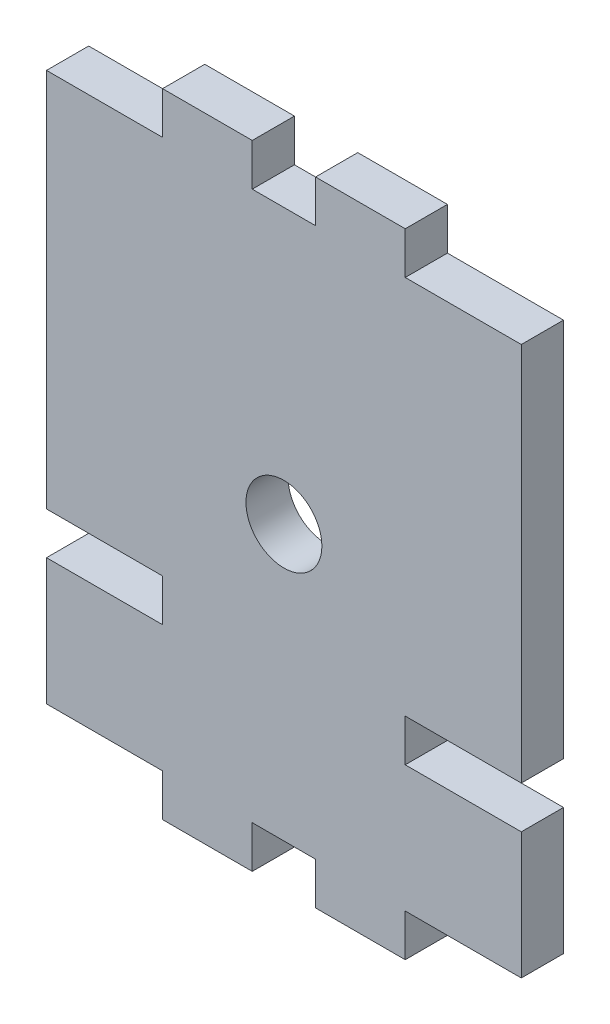
ISO-10303-21;
HEADER;
FILE_DESCRIPTION(('STEP AP214'),'2;1');
FILE_NAME('part.step','',(''),(''),'','','');
FILE_SCHEMA(('AUTOMOTIVE_DESIGN { 1 0 10303 214 1 1 1 1 }'));
ENDSEC;
DATA;
#1=APPLICATION_CONTEXT('core data for automotive mechanical design processes');
#2=APPLICATION_PROTOCOL_DEFINITION('international standard','automotive_design',2000,#1);
#3=PRODUCT_CONTEXT('',#1,'mechanical');
#4=PRODUCT('Part','Part','',(#3));
#5=PRODUCT_RELATED_PRODUCT_CATEGORY('part','',(#4));
#6=PRODUCT_DEFINITION_FORMATION('','',#4);
#7=PRODUCT_DEFINITION_CONTEXT('part definition',#1,'design');
#8=PRODUCT_DEFINITION('design','',#6,#7);
#9=PRODUCT_DEFINITION_SHAPE('','',#8);
#10=(LENGTH_UNIT() NAMED_UNIT(*) SI_UNIT(.MILLI.,.METRE.));
#11=(NAMED_UNIT(*) PLANE_ANGLE_UNIT() SI_UNIT($,.RADIAN.));
#12=(NAMED_UNIT(*) SI_UNIT($,.STERADIAN.) SOLID_ANGLE_UNIT());
#13=UNCERTAINTY_MEASURE_WITH_UNIT(LENGTH_MEASURE(1.E-05),#10,'distance_accuracy_value','');
#14=(GEOMETRIC_REPRESENTATION_CONTEXT(3) GLOBAL_UNCERTAINTY_ASSIGNED_CONTEXT((#13)) GLOBAL_UNIT_ASSIGNED_CONTEXT((#10,
#11,#12)) REPRESENTATION_CONTEXT('',''));
#15=CARTESIAN_POINT('',(0.,0.,0.));
#16=DIRECTION('',(0.,0.,1.));
#17=DIRECTION('',(1.,0.,0.));
#18=AXIS2_PLACEMENT_3D('',#15,#16,#17);
#19=CARTESIAN_POINT('',(0.,0.,4.));
#20=DIRECTION('',(-1.,0.,0.));
#21=DIRECTION('',(0.,0.,1.));
#22=AXIS2_PLACEMENT_3D('',#19,#20,#21);
#23=PLANE('',#22);
#24=DIRECTION('',(0.,1.,0.));
#25=VECTOR('',#24,1.);
#26=CARTESIAN_POINT('',(0.,0.,0.));
#27=LINE('',#26,#25);
#28=CARTESIAN_POINT('',(0.,20.,0.));
#29=VERTEX_POINT('',#28);
#30=CARTESIAN_POINT('',(0.,56.,0.));
#31=VERTEX_POINT('',#30);
#32=EDGE_CURVE('E453',#29,#31,#27,.T.);
#33=ORIENTED_EDGE('',*,*,#32,.F.);
#34=DIRECTION('',(0.,0.,-1.));
#35=VECTOR('',#34,1.);
#36=CARTESIAN_POINT('',(0.,20.,4.));
#37=LINE('',#36,#35);
#38=CARTESIAN_POINT('',(0.,20.,4.));
#39=VERTEX_POINT('',#38);
#40=EDGE_CURVE('E11',#39,#29,#37,.T.);
#41=ORIENTED_EDGE('',*,*,#40,.F.);
#42=DIRECTION('',(0.,1.,0.));
#43=VECTOR('',#42,1.);
#44=CARTESIAN_POINT('',(0.,0.,4.));
#45=LINE('',#44,#43);
#46=CARTESIAN_POINT('',(0.,56.,4.));
#47=VERTEX_POINT('',#46);
#48=EDGE_CURVE('E344',#39,#47,#45,.T.);
#49=ORIENTED_EDGE('',*,*,#48,.T.);
#50=DIRECTION('',(0.,0.,-1.));
#51=VECTOR('',#50,1.);
#52=CARTESIAN_POINT('',(0.,56.,4.));
#53=LINE('',#52,#51);
#54=EDGE_CURVE('E61',#47,#31,#53,.T.);
#55=ORIENTED_EDGE('',*,*,#54,.T.);
#56=EDGE_LOOP('',(#33,#41,#49,#55));
#57=FACE_BOUND('',#56,.T.);
#58=ADVANCED_FACE('F43',(#57),#23,.T.);
#59=CARTESIAN_POINT('',(0.,20.,4.));
#60=DIRECTION('',(0.,1.,0.));
#61=DIRECTION('',(0.,0.,1.));
#62=AXIS2_PLACEMENT_3D('',#59,#60,#61);
#63=PLANE('',#62);
#64=DIRECTION('',(1.,0.,0.));
#65=VECTOR('',#64,1.);
#66=CARTESIAN_POINT('',(0.,20.,0.));
#67=LINE('',#66,#65);
#68=CARTESIAN_POINT('',(11.,20.,0.));
#69=VERTEX_POINT('',#68);
#70=EDGE_CURVE('E450',#29,#69,#67,.T.);
#71=ORIENTED_EDGE('',*,*,#70,.T.);
#72=DIRECTION('',(0.,0.,-1.));
#73=VECTOR('',#72,1.);
#74=CARTESIAN_POINT('',(11.,20.,4.));
#75=LINE('',#74,#73);
#76=CARTESIAN_POINT('',(11.,20.,4.));
#77=VERTEX_POINT('',#76);
#78=EDGE_CURVE('E53',#77,#69,#75,.T.);
#79=ORIENTED_EDGE('',*,*,#78,.F.);
#80=DIRECTION('',(1.,0.,0.));
#81=VECTOR('',#80,1.);
#82=CARTESIAN_POINT('',(0.,20.,4.));
#83=LINE('',#82,#81);
#84=EDGE_CURVE('E340',#39,#77,#83,.T.);
#85=ORIENTED_EDGE('',*,*,#84,.F.);
#86=ORIENTED_EDGE('',*,*,#40,.T.);
#87=EDGE_LOOP('',(#71,#79,#85,#86));
#88=FACE_BOUND('',#87,.T.);
#89=ADVANCED_FACE('F451',(#88),#63,.F.);
#90=CARTESIAN_POINT('',(11.,0.,4.));
#91=DIRECTION('',(1.,0.,0.));
#92=DIRECTION('',(0.,1.,0.));
#93=AXIS2_PLACEMENT_3D('',#90,#91,#92);
#94=PLANE('',#93);
#95=DIRECTION('',(0.,-1.,0.));
#96=VECTOR('',#95,1.);
#97=CARTESIAN_POINT('',(11.,0.,0.));
#98=LINE('',#97,#96);
#99=CARTESIAN_POINT('',(11.,16.0000000000001,0.));
#100=VERTEX_POINT('',#99);
#101=EDGE_CURVE('E446',#69,#100,#98,.T.);
#102=ORIENTED_EDGE('',*,*,#101,.T.);
#103=DIRECTION('',(0.,0.,-1.));
#104=VECTOR('',#103,1.);
#105=CARTESIAN_POINT('',(11.,16.0000000000001,4.));
#106=LINE('',#105,#104);
#107=CARTESIAN_POINT('',(11.,16.0000000000001,4.));
#108=VERTEX_POINT('',#107);
#109=EDGE_CURVE('E436',#108,#100,#106,.T.);
#110=ORIENTED_EDGE('',*,*,#109,.F.);
#111=DIRECTION('',(0.,-1.,0.));
#112=VECTOR('',#111,1.);
#113=CARTESIAN_POINT('',(11.,0.,4.));
#114=LINE('',#113,#112);
#115=EDGE_CURVE('E337',#77,#108,#114,.T.);
#116=ORIENTED_EDGE('',*,*,#115,.F.);
#117=ORIENTED_EDGE('',*,*,#78,.T.);
#118=EDGE_LOOP('',(#102,#110,#116,#117));
#119=FACE_BOUND('',#118,.T.);
#120=ADVANCED_FACE('F444',(#119),#94,.F.);
#121=CARTESIAN_POINT('',(0.,16.0000000000001,4.));
#122=DIRECTION('',(0.,1.,0.));
#123=DIRECTION('',(0.,0.,1.));
#124=AXIS2_PLACEMENT_3D('',#121,#122,#123);
#125=PLANE('',#124);
#126=DIRECTION('',(1.,0.,0.));
#127=VECTOR('',#126,1.);
#128=CARTESIAN_POINT('',(0.,16.0000000000001,0.));
#129=LINE('',#128,#127);
#130=CARTESIAN_POINT('',(0.,16.0000000000001,0.));
#131=VERTEX_POINT('',#130);
#132=EDGE_CURVE('E457',#131,#100,#129,.T.);
#133=ORIENTED_EDGE('',*,*,#132,.F.);
#134=DIRECTION('',(0.,0.,-1.));
#135=VECTOR('',#134,1.);
#136=CARTESIAN_POINT('',(0.,16.0000000000001,4.));
#137=LINE('',#136,#135);
#138=CARTESIAN_POINT('',(0.,16.0000000000001,4.));
#139=VERTEX_POINT('',#138);
#140=EDGE_CURVE('E433',#139,#131,#137,.T.);
#141=ORIENTED_EDGE('',*,*,#140,.F.);
#142=DIRECTION('',(1.,0.,0.));
#143=VECTOR('',#142,1.);
#144=CARTESIAN_POINT('',(0.,16.0000000000001,4.));
#145=LINE('',#144,#143);
#146=EDGE_CURVE('E333',#139,#108,#145,.T.);
#147=ORIENTED_EDGE('',*,*,#146,.T.);
#148=ORIENTED_EDGE('',*,*,#109,.T.);
#149=EDGE_LOOP('',(#133,#141,#147,#148));
#150=FACE_BOUND('',#149,.T.);
#151=ADVANCED_FACE('F566',(#150),#125,.T.);
#152=CARTESIAN_POINT('',(0.,0.,4.));
#153=DIRECTION('',(-1.,0.,0.));
#154=DIRECTION('',(0.,0.,1.));
#155=AXIS2_PLACEMENT_3D('',#152,#153,#154);
#156=PLANE('',#155);
#157=DIRECTION('',(0.,1.,0.));
#158=VECTOR('',#157,1.);
#159=CARTESIAN_POINT('',(0.,0.,0.));
#160=LINE('',#159,#158);
#161=CARTESIAN_POINT('',(0.,4.,0.));
#162=VERTEX_POINT('',#161);
#163=EDGE_CURVE('E465',#162,#131,#160,.T.);
#164=ORIENTED_EDGE('',*,*,#163,.F.);
#165=DIRECTION('',(0.,0.,-1.));
#166=VECTOR('',#165,1.);
#167=CARTESIAN_POINT('',(0.,4.,4.));
#168=LINE('',#167,#166);
#169=CARTESIAN_POINT('',(0.,4.,4.));
#170=VERTEX_POINT('',#169);
#171=EDGE_CURVE('E430',#170,#162,#168,.T.);
#172=ORIENTED_EDGE('',*,*,#171,.F.);
#173=DIRECTION('',(0.,1.,0.));
#174=VECTOR('',#173,1.);
#175=CARTESIAN_POINT('',(0.,0.,4.));
#176=LINE('',#175,#174);
#177=EDGE_CURVE('E329',#170,#139,#176,.T.);
#178=ORIENTED_EDGE('',*,*,#177,.T.);
#179=ORIENTED_EDGE('',*,*,#140,.T.);
#180=EDGE_LOOP('',(#164,#172,#178,#179));
#181=FACE_BOUND('',#180,.T.);
#182=ADVANCED_FACE('F569',(#181),#156,.T.);
#183=CARTESIAN_POINT('',(0.,3.99999999999998,4.));
#184=DIRECTION('',(0.,1.,0.));
#185=DIRECTION('',(-1.,0.,0.));
#186=AXIS2_PLACEMENT_3D('',#183,#184,#185);
#187=PLANE('',#186);
#188=DIRECTION('',(1.,0.,0.));
#189=VECTOR('',#188,1.);
#190=CARTESIAN_POINT('',(0.,3.99999999999998,0.));
#191=LINE('',#190,#189);
#192=CARTESIAN_POINT('',(11.,4.00000000000002,0.));
#193=VERTEX_POINT('',#192);
#194=EDGE_CURVE('E469',#162,#193,#191,.T.);
#195=ORIENTED_EDGE('',*,*,#194,.T.);
#196=DIRECTION('',(0.,0.,-1.));
#197=VECTOR('',#196,1.);
#198=CARTESIAN_POINT('',(11.,4.00000000000002,4.));
#199=LINE('',#198,#197);
#200=CARTESIAN_POINT('',(11.,4.00000000000002,4.));
#201=VERTEX_POINT('',#200);
#202=EDGE_CURVE('E427',#201,#193,#199,.T.);
#203=ORIENTED_EDGE('',*,*,#202,.F.);
#204=DIRECTION('',(1.,0.,0.));
#205=VECTOR('',#204,1.);
#206=CARTESIAN_POINT('',(0.,3.99999999999998,4.));
#207=LINE('',#206,#205);
#208=EDGE_CURVE('E326',#170,#201,#207,.T.);
#209=ORIENTED_EDGE('',*,*,#208,.F.);
#210=ORIENTED_EDGE('',*,*,#171,.T.);
#211=EDGE_LOOP('',(#195,#203,#209,#210));
#212=FACE_BOUND('',#211,.T.);
#213=ADVANCED_FACE('F573',(#212),#187,.F.);
#214=CARTESIAN_POINT('',(11.,0.,4.));
#215=DIRECTION('',(-1.,0.,0.));
#216=DIRECTION('',(0.,-1.,0.));
#217=AXIS2_PLACEMENT_3D('',#214,#215,#216);
#218=PLANE('',#217);
#219=DIRECTION('',(0.,1.,0.));
#220=VECTOR('',#219,1.);
#221=CARTESIAN_POINT('',(11.,0.,0.));
#222=LINE('',#221,#220);
#223=CARTESIAN_POINT('',(11.,0.,0.));
#224=VERTEX_POINT('',#223);
#225=EDGE_CURVE('E473',#224,#193,#222,.T.);
#226=ORIENTED_EDGE('',*,*,#225,.F.);
#227=DIRECTION('',(0.,0.,-1.));
#228=VECTOR('',#227,1.);
#229=CARTESIAN_POINT('',(11.,0.,4.));
#230=LINE('',#229,#228);
#231=CARTESIAN_POINT('',(11.,0.,4.));
#232=VERTEX_POINT('',#231);
#233=EDGE_CURVE('E424',#232,#224,#230,.T.);
#234=ORIENTED_EDGE('',*,*,#233,.F.);
#235=DIRECTION('',(0.,1.,0.));
#236=VECTOR('',#235,1.);
#237=CARTESIAN_POINT('',(11.,0.,4.));
#238=LINE('',#237,#236);
#239=EDGE_CURVE('E322',#232,#201,#238,.T.);
#240=ORIENTED_EDGE('',*,*,#239,.T.);
#241=ORIENTED_EDGE('',*,*,#202,.T.);
#242=EDGE_LOOP('',(#226,#234,#240,#241));
#243=FACE_BOUND('',#242,.T.);
#244=ADVANCED_FACE('F577',(#243),#218,.T.);
#245=CARTESIAN_POINT('',(0.,0.,4.));
#246=DIRECTION('',(0.,1.,0.));
#247=DIRECTION('',(0.,0.,1.));
#248=AXIS2_PLACEMENT_3D('',#245,#246,#247);
#249=PLANE('',#248);
#250=DIRECTION('',(1.,0.,0.));
#251=VECTOR('',#250,1.);
#252=CARTESIAN_POINT('',(0.,0.,0.));
#253=LINE('',#252,#251);
#254=CARTESIAN_POINT('',(19.5,0.,0.));
#255=VERTEX_POINT('',#254);
#256=EDGE_CURVE('E477',#224,#255,#253,.T.);
#257=ORIENTED_EDGE('',*,*,#256,.T.);
#258=DIRECTION('',(0.,0.,-1.));
#259=VECTOR('',#258,1.);
#260=CARTESIAN_POINT('',(19.5,0.,4.));
#261=LINE('',#260,#259);
#262=CARTESIAN_POINT('',(19.5,0.,4.));
#263=VERTEX_POINT('',#262);
#264=EDGE_CURVE('E420',#263,#255,#261,.T.);
#265=ORIENTED_EDGE('',*,*,#264,.F.);
#266=DIRECTION('',(1.,0.,0.));
#267=VECTOR('',#266,1.);
#268=CARTESIAN_POINT('',(0.,0.,4.));
#269=LINE('',#268,#267);
#270=EDGE_CURVE('E318',#232,#263,#269,.T.);
#271=ORIENTED_EDGE('',*,*,#270,.F.);
#272=ORIENTED_EDGE('',*,*,#233,.T.);
#273=EDGE_LOOP('',(#257,#265,#271,#272));
#274=FACE_BOUND('',#273,.T.);
#275=ADVANCED_FACE('F581',(#274),#249,.F.);
#276=CARTESIAN_POINT('',(19.5,0.,4.));
#277=DIRECTION('',(-1.,0.,0.));
#278=DIRECTION('',(0.,0.,1.));
#279=AXIS2_PLACEMENT_3D('',#276,#277,#278);
#280=PLANE('',#279);
#281=DIRECTION('',(0.,1.,0.));
#282=VECTOR('',#281,1.);
#283=CARTESIAN_POINT('',(19.5,0.,0.));
#284=LINE('',#283,#282);
#285=CARTESIAN_POINT('',(19.5,4.00000000000003,0.));
#286=VERTEX_POINT('',#285);
#287=EDGE_CURVE('E481',#255,#286,#284,.T.);
#288=ORIENTED_EDGE('',*,*,#287,.T.);
#289=DIRECTION('',(0.,0.,-1.));
#290=VECTOR('',#289,1.);
#291=CARTESIAN_POINT('',(19.5,4.00000000000003,4.));
#292=LINE('',#291,#290);
#293=CARTESIAN_POINT('',(19.5,4.00000000000003,4.));
#294=VERTEX_POINT('',#293);
#295=EDGE_CURVE('E416',#294,#286,#292,.T.);
#296=ORIENTED_EDGE('',*,*,#295,.F.);
#297=DIRECTION('',(0.,1.,0.));
#298=VECTOR('',#297,1.);
#299=CARTESIAN_POINT('',(19.5,0.,4.));
#300=LINE('',#299,#298);
#301=EDGE_CURVE('E314',#263,#294,#300,.T.);
#302=ORIENTED_EDGE('',*,*,#301,.F.);
#303=ORIENTED_EDGE('',*,*,#264,.T.);
#304=EDGE_LOOP('',(#288,#296,#302,#303));
#305=FACE_BOUND('',#304,.T.);
#306=ADVANCED_FACE('F583',(#305),#280,.F.);
#307=CARTESIAN_POINT('',(0.,4.00000000000003,4.));
#308=DIRECTION('',(0.,1.,0.));
#309=DIRECTION('',(0.,0.,1.));
#310=AXIS2_PLACEMENT_3D('',#307,#308,#309);
#311=PLANE('',#310);
#312=DIRECTION('',(1.,0.,0.));
#313=VECTOR('',#312,1.);
#314=CARTESIAN_POINT('',(0.,4.00000000000003,0.));
#315=LINE('',#314,#313);
#316=CARTESIAN_POINT('',(25.5,4.00000000000003,0.));
#317=VERTEX_POINT('',#316);
#318=EDGE_CURVE('E486',#286,#317,#315,.T.);
#319=ORIENTED_EDGE('',*,*,#318,.T.);
#320=DIRECTION('',(0.,0.,-1.));
#321=VECTOR('',#320,1.);
#322=CARTESIAN_POINT('',(25.5,4.00000000000003,4.));
#323=LINE('',#322,#321);
#324=CARTESIAN_POINT('',(25.5,4.00000000000003,4.));
#325=VERTEX_POINT('',#324);
#326=EDGE_CURVE('E413',#325,#317,#323,.T.);
#327=ORIENTED_EDGE('',*,*,#326,.F.);
#328=DIRECTION('',(1.,0.,0.));
#329=VECTOR('',#328,1.);
#330=CARTESIAN_POINT('',(0.,4.00000000000003,4.));
#331=LINE('',#330,#329);
#332=EDGE_CURVE('E311',#294,#325,#331,.T.);
#333=ORIENTED_EDGE('',*,*,#332,.F.);
#334=ORIENTED_EDGE('',*,*,#295,.T.);
#335=EDGE_LOOP('',(#319,#327,#333,#334));
#336=FACE_BOUND('',#335,.T.);
#337=ADVANCED_FACE('F586',(#336),#311,.F.);
#338=CARTESIAN_POINT('',(25.5,0.,4.));
#339=DIRECTION('',(-1.,0.,0.));
#340=DIRECTION('',(0.,0.,1.));
#341=AXIS2_PLACEMENT_3D('',#338,#339,#340);
#342=PLANE('',#341);
#343=DIRECTION('',(0.,1.,0.));
#344=VECTOR('',#343,1.);
#345=CARTESIAN_POINT('',(25.5,0.,0.));
#346=LINE('',#345,#344);
#347=CARTESIAN_POINT('',(25.5,0.,0.));
#348=VERTEX_POINT('',#347);
#349=EDGE_CURVE('E490',#348,#317,#346,.T.);
#350=ORIENTED_EDGE('',*,*,#349,.F.);
#351=DIRECTION('',(0.,0.,-1.));
#352=VECTOR('',#351,1.);
#353=CARTESIAN_POINT('',(25.5,0.,4.));
#354=LINE('',#353,#352);
#355=CARTESIAN_POINT('',(25.5,0.,4.));
#356=VERTEX_POINT('',#355);
#357=EDGE_CURVE('E410',#356,#348,#354,.T.);
#358=ORIENTED_EDGE('',*,*,#357,.F.);
#359=DIRECTION('',(0.,1.,0.));
#360=VECTOR('',#359,1.);
#361=CARTESIAN_POINT('',(25.5,0.,4.));
#362=LINE('',#361,#360);
#363=EDGE_CURVE('E307',#356,#325,#362,.T.);
#364=ORIENTED_EDGE('',*,*,#363,.T.);
#365=ORIENTED_EDGE('',*,*,#326,.T.);
#366=EDGE_LOOP('',(#350,#358,#364,#365));
#367=FACE_BOUND('',#366,.T.);
#368=ADVANCED_FACE('F590',(#367),#342,.T.);
#369=CARTESIAN_POINT('',(34.,0.,0.));
#370=VERTEX_POINT('',#369);
#371=EDGE_CURVE('E482',#348,#370,#253,.T.);
#372=ORIENTED_EDGE('',*,*,#371,.T.);
#373=DIRECTION('',(0.,0.,-1.));
#374=VECTOR('',#373,1.);
#375=CARTESIAN_POINT('',(34.,0.,4.));
#376=LINE('',#375,#374);
#377=CARTESIAN_POINT('',(34.,0.,4.));
#378=VERTEX_POINT('',#377);
#379=EDGE_CURVE('E406',#378,#370,#376,.T.);
#380=ORIENTED_EDGE('',*,*,#379,.F.);
#381=EDGE_CURVE('E306',#356,#378,#269,.T.);
#382=ORIENTED_EDGE('',*,*,#381,.F.);
#383=ORIENTED_EDGE('',*,*,#357,.T.);
#384=EDGE_LOOP('',(#372,#380,#382,#383));
#385=FACE_BOUND('',#384,.T.);
#386=ADVANCED_FACE('F594',(#385),#249,.F.);
#387=CARTESIAN_POINT('',(34.,0.,4.));
#388=DIRECTION('',(-1.,0.,0.));
#389=DIRECTION('',(0.,0.,1.));
#390=AXIS2_PLACEMENT_3D('',#387,#388,#389);
#391=PLANE('',#390);
#392=DIRECTION('',(0.,1.,0.));
#393=VECTOR('',#392,1.);
#394=CARTESIAN_POINT('',(34.,0.,0.));
#395=LINE('',#394,#393);
#396=CARTESIAN_POINT('',(34.,4.00000000000003,0.));
#397=VERTEX_POINT('',#396);
#398=EDGE_CURVE('E494',#370,#397,#395,.T.);
#399=ORIENTED_EDGE('',*,*,#398,.T.);
#400=DIRECTION('',(0.,0.,-1.));
#401=VECTOR('',#400,1.);
#402=CARTESIAN_POINT('',(34.,4.00000000000003,4.));
#403=LINE('',#402,#401);
#404=CARTESIAN_POINT('',(34.,4.00000000000003,4.));
#405=VERTEX_POINT('',#404);
#406=EDGE_CURVE('E403',#405,#397,#403,.T.);
#407=ORIENTED_EDGE('',*,*,#406,.F.);
#408=DIRECTION('',(0.,1.,0.));
#409=VECTOR('',#408,1.);
#410=CARTESIAN_POINT('',(34.,0.,4.));
#411=LINE('',#410,#409);
#412=EDGE_CURVE('E303',#378,#405,#411,.T.);
#413=ORIENTED_EDGE('',*,*,#412,.F.);
#414=ORIENTED_EDGE('',*,*,#379,.T.);
#415=EDGE_LOOP('',(#399,#407,#413,#414));
#416=FACE_BOUND('',#415,.T.);
#417=ADVANCED_FACE('F598',(#416),#391,.F.);
#418=CARTESIAN_POINT('',(0.,4.00000000000018,4.));
#419=DIRECTION('',(0.,-1.,0.));
#420=DIRECTION('',(1.,0.,0.));
#421=AXIS2_PLACEMENT_3D('',#418,#419,#420);
#422=PLANE('',#421);
#423=DIRECTION('',(-1.,0.,0.));
#424=VECTOR('',#423,1.);
#425=CARTESIAN_POINT('',(0.,4.00000000000018,0.));
#426=LINE('',#425,#424);
#427=CARTESIAN_POINT('',(45.,4.00000000000001,0.));
#428=VERTEX_POINT('',#427);
#429=EDGE_CURVE('E498',#428,#397,#426,.T.);
#430=ORIENTED_EDGE('',*,*,#429,.F.);
#431=DIRECTION('',(0.,0.,-1.));
#432=VECTOR('',#431,1.);
#433=CARTESIAN_POINT('',(45.,4.00000000000001,4.));
#434=LINE('',#433,#432);
#435=CARTESIAN_POINT('',(45.,4.00000000000001,4.));
#436=VERTEX_POINT('',#435);
#437=EDGE_CURVE('E400',#436,#428,#434,.T.);
#438=ORIENTED_EDGE('',*,*,#437,.F.);
#439=DIRECTION('',(-1.,0.,0.));
#440=VECTOR('',#439,1.);
#441=CARTESIAN_POINT('',(0.,4.00000000000018,4.));
#442=LINE('',#441,#440);
#443=EDGE_CURVE('E299',#436,#405,#442,.T.);
#444=ORIENTED_EDGE('',*,*,#443,.T.);
#445=ORIENTED_EDGE('',*,*,#406,.T.);
#446=EDGE_LOOP('',(#430,#438,#444,#445));
#447=FACE_BOUND('',#446,.T.);
#448=ADVANCED_FACE('F602',(#447),#422,.T.);
#449=CARTESIAN_POINT('',(45.,0.,4.));
#450=DIRECTION('',(-1.,0.,0.));
#451=DIRECTION('',(0.,0.,1.));
#452=AXIS2_PLACEMENT_3D('',#449,#450,#451);
#453=PLANE('',#452);
#454=DIRECTION('',(0.,1.,0.));
#455=VECTOR('',#454,1.);
#456=CARTESIAN_POINT('',(45.,0.,0.));
#457=LINE('',#456,#455);
#458=CARTESIAN_POINT('',(45.,16.0000000000001,0.));
#459=VERTEX_POINT('',#458);
#460=EDGE_CURVE('E502',#428,#459,#457,.T.);
#461=ORIENTED_EDGE('',*,*,#460,.T.);
#462=DIRECTION('',(0.,0.,-1.));
#463=VECTOR('',#462,1.);
#464=CARTESIAN_POINT('',(45.,16.0000000000001,4.));
#465=LINE('',#464,#463);
#466=CARTESIAN_POINT('',(45.,16.0000000000001,4.));
#467=VERTEX_POINT('',#466);
#468=EDGE_CURVE('E396',#467,#459,#465,.T.);
#469=ORIENTED_EDGE('',*,*,#468,.F.);
#470=DIRECTION('',(0.,1.,0.));
#471=VECTOR('',#470,1.);
#472=CARTESIAN_POINT('',(45.,0.,4.));
#473=LINE('',#472,#471);
#474=EDGE_CURVE('E295',#436,#467,#473,.T.);
#475=ORIENTED_EDGE('',*,*,#474,.F.);
#476=ORIENTED_EDGE('',*,*,#437,.T.);
#477=EDGE_LOOP('',(#461,#469,#475,#476));
#478=FACE_BOUND('',#477,.T.);
#479=ADVANCED_FACE('F606',(#478),#453,.F.);
#480=CARTESIAN_POINT('',(0.,16.0000000000001,4.));
#481=DIRECTION('',(0.,-1.,0.));
#482=DIRECTION('',(0.,0.,-1.));
#483=AXIS2_PLACEMENT_3D('',#480,#481,#482);
#484=PLANE('',#483);
#485=DIRECTION('',(-1.,0.,0.));
#486=VECTOR('',#485,1.);
#487=CARTESIAN_POINT('',(0.,16.0000000000001,0.));
#488=LINE('',#487,#486);
#489=CARTESIAN_POINT('',(34.,16.0000000000001,0.));
#490=VERTEX_POINT('',#489);
#491=EDGE_CURVE('E506',#459,#490,#488,.T.);
#492=ORIENTED_EDGE('',*,*,#491,.T.);
#493=DIRECTION('',(0.,0.,-1.));
#494=VECTOR('',#493,1.);
#495=CARTESIAN_POINT('',(34.,16.0000000000001,4.));
#496=LINE('',#495,#494);
#497=CARTESIAN_POINT('',(34.,16.0000000000001,4.));
#498=VERTEX_POINT('',#497);
#499=EDGE_CURVE('E393',#498,#490,#496,.T.);
#500=ORIENTED_EDGE('',*,*,#499,.F.);
#501=DIRECTION('',(-1.,0.,0.));
#502=VECTOR('',#501,1.);
#503=CARTESIAN_POINT('',(0.,16.0000000000001,4.));
#504=LINE('',#503,#502);
#505=EDGE_CURVE('E292',#467,#498,#504,.T.);
#506=ORIENTED_EDGE('',*,*,#505,.F.);
#507=ORIENTED_EDGE('',*,*,#468,.T.);
#508=EDGE_LOOP('',(#492,#500,#506,#507));
#509=FACE_BOUND('',#508,.T.);
#510=ADVANCED_FACE('F610',(#509),#484,.F.);
#511=CARTESIAN_POINT('',(34.,0.,4.));
#512=DIRECTION('',(1.,0.,0.));
#513=DIRECTION('',(0.,0.,-1.));
#514=AXIS2_PLACEMENT_3D('',#511,#512,#513);
#515=PLANE('',#514);
#516=DIRECTION('',(0.,-1.,0.));
#517=VECTOR('',#516,1.);
#518=CARTESIAN_POINT('',(34.,0.,0.));
#519=LINE('',#518,#517);
#520=CARTESIAN_POINT('',(34.,20.,0.));
#521=VERTEX_POINT('',#520);
#522=EDGE_CURVE('E510',#521,#490,#519,.T.);
#523=ORIENTED_EDGE('',*,*,#522,.F.);
#524=DIRECTION('',(0.,0.,-1.));
#525=VECTOR('',#524,1.);
#526=CARTESIAN_POINT('',(34.,20.,4.));
#527=LINE('',#526,#525);
#528=CARTESIAN_POINT('',(34.,20.,4.));
#529=VERTEX_POINT('',#528);
#530=EDGE_CURVE('E390',#529,#521,#527,.T.);
#531=ORIENTED_EDGE('',*,*,#530,.F.);
#532=DIRECTION('',(0.,-1.,0.));
#533=VECTOR('',#532,1.);
#534=CARTESIAN_POINT('',(34.,0.,4.));
#535=LINE('',#534,#533);
#536=EDGE_CURVE('E288',#529,#498,#535,.T.);
#537=ORIENTED_EDGE('',*,*,#536,.T.);
#538=ORIENTED_EDGE('',*,*,#499,.T.);
#539=EDGE_LOOP('',(#523,#531,#537,#538));
#540=FACE_BOUND('',#539,.T.);
#541=ADVANCED_FACE('F614',(#540),#515,.T.);
#542=CARTESIAN_POINT('',(0.,20.,4.));
#543=DIRECTION('',(0.,-1.,0.));
#544=DIRECTION('',(0.,0.,-1.));
#545=AXIS2_PLACEMENT_3D('',#542,#543,#544);
#546=PLANE('',#545);
#547=DIRECTION('',(-1.,0.,0.));
#548=VECTOR('',#547,1.);
#549=CARTESIAN_POINT('',(0.,20.,0.));
#550=LINE('',#549,#548);
#551=CARTESIAN_POINT('',(45.,20.,0.));
#552=VERTEX_POINT('',#551);
#553=EDGE_CURVE('E514',#552,#521,#550,.T.);
#554=ORIENTED_EDGE('',*,*,#553,.F.);
#555=DIRECTION('',(0.,0.,-1.));
#556=VECTOR('',#555,1.);
#557=CARTESIAN_POINT('',(45.,20.,4.));
#558=LINE('',#557,#556);
#559=CARTESIAN_POINT('',(45.,20.,4.));
#560=VERTEX_POINT('',#559);
#561=EDGE_CURVE('E387',#560,#552,#558,.T.);
#562=ORIENTED_EDGE('',*,*,#561,.F.);
#563=DIRECTION('',(-1.,0.,0.));
#564=VECTOR('',#563,1.);
#565=CARTESIAN_POINT('',(0.,20.,4.));
#566=LINE('',#565,#564);
#567=EDGE_CURVE('E284',#560,#529,#566,.T.);
#568=ORIENTED_EDGE('',*,*,#567,.T.);
#569=ORIENTED_EDGE('',*,*,#530,.T.);
#570=EDGE_LOOP('',(#554,#562,#568,#569));
#571=FACE_BOUND('',#570,.T.);
#572=ADVANCED_FACE('F618',(#571),#546,.T.);
#573=CARTESIAN_POINT('',(45.,0.,4.));
#574=DIRECTION('',(-1.,0.,0.));
#575=DIRECTION('',(0.,0.,1.));
#576=AXIS2_PLACEMENT_3D('',#573,#574,#575);
#577=PLANE('',#576);
#578=DIRECTION('',(0.,1.,0.));
#579=VECTOR('',#578,1.);
#580=CARTESIAN_POINT('',(45.,0.,0.));
#581=LINE('',#580,#579);
#582=CARTESIAN_POINT('',(45.,56.,0.));
#583=VERTEX_POINT('',#582);
#584=EDGE_CURVE('E518',#552,#583,#581,.T.);
#585=ORIENTED_EDGE('',*,*,#584,.T.);
#586=DIRECTION('',(0.,0.,-1.));
#587=VECTOR('',#586,1.);
#588=CARTESIAN_POINT('',(45.,56.,4.));
#589=LINE('',#588,#587);
#590=CARTESIAN_POINT('',(45.,56.,4.));
#591=VERTEX_POINT('',#590);
#592=EDGE_CURVE('E383',#591,#583,#589,.T.);
#593=ORIENTED_EDGE('',*,*,#592,.F.);
#594=DIRECTION('',(0.,1.,0.));
#595=VECTOR('',#594,1.);
#596=CARTESIAN_POINT('',(45.,0.,4.));
#597=LINE('',#596,#595);
#598=EDGE_CURVE('E278',#560,#591,#597,.T.);
#599=ORIENTED_EDGE('',*,*,#598,.F.);
#600=ORIENTED_EDGE('',*,*,#561,.T.);
#601=EDGE_LOOP('',(#585,#593,#599,#600));
#602=FACE_BOUND('',#601,.T.);
#603=ADVANCED_FACE('F622',(#602),#577,.F.);
#604=CARTESIAN_POINT('',(0.,55.9999999999999,4.));
#605=DIRECTION('',(0.,-1.,0.));
#606=DIRECTION('',(1.,0.,0.));
#607=AXIS2_PLACEMENT_3D('',#604,#605,#606);
#608=PLANE('',#607);
#609=DIRECTION('',(-1.,0.,0.));
#610=VECTOR('',#609,1.);
#611=CARTESIAN_POINT('',(0.,55.9999999999999,0.));
#612=LINE('',#611,#610);
#613=CARTESIAN_POINT('',(34.,56.,0.));
#614=VERTEX_POINT('',#613);
#615=EDGE_CURVE('E522',#583,#614,#612,.T.);
#616=ORIENTED_EDGE('',*,*,#615,.T.);
#617=DIRECTION('',(0.,0.,-1.));
#618=VECTOR('',#617,1.);
#619=CARTESIAN_POINT('',(34.,56.,4.));
#620=LINE('',#619,#618);
#621=CARTESIAN_POINT('',(34.,56.,4.));
#622=VERTEX_POINT('',#621);
#623=EDGE_CURVE('E380',#622,#614,#620,.T.);
#624=ORIENTED_EDGE('',*,*,#623,.F.);
#625=DIRECTION('',(-1.,0.,0.));
#626=VECTOR('',#625,1.);
#627=CARTESIAN_POINT('',(0.,55.9999999999999,4.));
#628=LINE('',#627,#626);
#629=EDGE_CURVE('E274',#591,#622,#628,.T.);
#630=ORIENTED_EDGE('',*,*,#629,.F.);
#631=ORIENTED_EDGE('',*,*,#592,.T.);
#632=EDGE_LOOP('',(#616,#624,#630,#631));
#633=FACE_BOUND('',#632,.T.);
#634=ADVANCED_FACE('F626',(#633),#608,.F.);
#635=CARTESIAN_POINT('',(34.,0.,4.));
#636=DIRECTION('',(1.,0.,0.));
#637=DIRECTION('',(0.,0.,-1.));
#638=AXIS2_PLACEMENT_3D('',#635,#636,#637);
#639=PLANE('',#638);
#640=DIRECTION('',(0.,-1.,0.));
#641=VECTOR('',#640,1.);
#642=CARTESIAN_POINT('',(34.,0.,0.));
#643=LINE('',#642,#641);
#644=CARTESIAN_POINT('',(34.,60.,0.));
#645=VERTEX_POINT('',#644);
#646=EDGE_CURVE('E526',#645,#614,#643,.T.);
#647=ORIENTED_EDGE('',*,*,#646,.F.);
#648=DIRECTION('',(0.,0.,-1.));
#649=VECTOR('',#648,1.);
#650=CARTESIAN_POINT('',(34.,60.,4.));
#651=LINE('',#650,#649);
#652=CARTESIAN_POINT('',(34.,60.,4.));
#653=VERTEX_POINT('',#652);
#654=EDGE_CURVE('E377',#653,#645,#651,.T.);
#655=ORIENTED_EDGE('',*,*,#654,.F.);
#656=DIRECTION('',(0.,-1.,0.));
#657=VECTOR('',#656,1.);
#658=CARTESIAN_POINT('',(34.,0.,4.));
#659=LINE('',#658,#657);
#660=EDGE_CURVE('E268',#653,#622,#659,.T.);
#661=ORIENTED_EDGE('',*,*,#660,.T.);
#662=ORIENTED_EDGE('',*,*,#623,.T.);
#663=EDGE_LOOP('',(#647,#655,#661,#662));
#664=FACE_BOUND('',#663,.T.);
#665=ADVANCED_FACE('F630',(#664),#639,.T.);
#666=CARTESIAN_POINT('',(0.,60.,4.));
#667=DIRECTION('',(0.,1.,0.));
#668=DIRECTION('',(-1.,0.,0.));
#669=AXIS2_PLACEMENT_3D('',#666,#667,#668);
#670=PLANE('',#669);
#671=DIRECTION('',(1.,0.,0.));
#672=VECTOR('',#671,1.);
#673=CARTESIAN_POINT('',(0.,60.,0.));
#674=LINE('',#673,#672);
#675=CARTESIAN_POINT('',(25.5,60.,0.));
#676=VERTEX_POINT('',#675);
#677=EDGE_CURVE('E530',#676,#645,#674,.T.);
#678=ORIENTED_EDGE('',*,*,#677,.F.);
#679=DIRECTION('',(0.,0.,-1.));
#680=VECTOR('',#679,1.);
#681=CARTESIAN_POINT('',(25.5,60.,4.));
#682=LINE('',#681,#680);
#683=CARTESIAN_POINT('',(25.5,60.,4.));
#684=VERTEX_POINT('',#683);
#685=EDGE_CURVE('E374',#684,#676,#682,.T.);
#686=ORIENTED_EDGE('',*,*,#685,.F.);
#687=DIRECTION('',(1.,0.,0.));
#688=VECTOR('',#687,1.);
#689=CARTESIAN_POINT('',(0.,60.,4.));
#690=LINE('',#689,#688);
#691=EDGE_CURVE('E259',#684,#653,#690,.T.);
#692=ORIENTED_EDGE('',*,*,#691,.T.);
#693=ORIENTED_EDGE('',*,*,#654,.T.);
#694=EDGE_LOOP('',(#678,#686,#692,#693));
#695=FACE_BOUND('',#694,.T.);
#696=ADVANCED_FACE('F634',(#695),#670,.T.);
#697=CARTESIAN_POINT('',(25.5,0.,4.));
#698=DIRECTION('',(1.,0.,0.));
#699=DIRECTION('',(0.,0.,-1.));
#700=AXIS2_PLACEMENT_3D('',#697,#698,#699);
#701=PLANE('',#700);
#702=DIRECTION('',(0.,-1.,0.));
#703=VECTOR('',#702,1.);
#704=CARTESIAN_POINT('',(25.5,0.,0.));
#705=LINE('',#704,#703);
#706=CARTESIAN_POINT('',(25.5,56.,0.));
#707=VERTEX_POINT('',#706);
#708=EDGE_CURVE('E534',#676,#707,#705,.T.);
#709=ORIENTED_EDGE('',*,*,#708,.T.);
#710=DIRECTION('',(0.,0.,-1.));
#711=VECTOR('',#710,1.);
#712=CARTESIAN_POINT('',(25.5,56.,4.));
#713=LINE('',#712,#711);
#714=CARTESIAN_POINT('',(25.5,56.,4.));
#715=VERTEX_POINT('',#714);
#716=EDGE_CURVE('E371',#715,#707,#713,.T.);
#717=ORIENTED_EDGE('',*,*,#716,.F.);
#718=DIRECTION('',(0.,-1.,0.));
#719=VECTOR('',#718,1.);
#720=CARTESIAN_POINT('',(25.5,0.,4.));
#721=LINE('',#720,#719);
#722=EDGE_CURVE('E267',#684,#715,#721,.T.);
#723=ORIENTED_EDGE('',*,*,#722,.F.);
#724=ORIENTED_EDGE('',*,*,#685,.T.);
#725=EDGE_LOOP('',(#709,#717,#723,#724));
#726=FACE_BOUND('',#725,.T.);
#727=ADVANCED_FACE('F635',(#726),#701,.F.);
#728=CARTESIAN_POINT('',(0.,56.,4.));
#729=DIRECTION('',(0.,1.,0.));
#730=DIRECTION('',(0.,0.,1.));
#731=AXIS2_PLACEMENT_3D('',#728,#729,#730);
#732=PLANE('',#731);
#733=DIRECTION('',(1.,0.,0.));
#734=VECTOR('',#733,1.);
#735=CARTESIAN_POINT('',(0.,56.,0.));
#736=LINE('',#735,#734);
#737=CARTESIAN_POINT('',(19.5,56.,0.));
#738=VERTEX_POINT('',#737);
#739=EDGE_CURVE('E538',#738,#707,#736,.T.);
#740=ORIENTED_EDGE('',*,*,#739,.F.);
#741=DIRECTION('',(0.,0.,-1.));
#742=VECTOR('',#741,1.);
#743=CARTESIAN_POINT('',(19.5,56.,4.));
#744=LINE('',#743,#742);
#745=CARTESIAN_POINT('',(19.5,56.,4.));
#746=VERTEX_POINT('',#745);
#747=EDGE_CURVE('E368',#746,#738,#744,.T.);
#748=ORIENTED_EDGE('',*,*,#747,.F.);
#749=DIRECTION('',(1.,0.,0.));
#750=VECTOR('',#749,1.);
#751=CARTESIAN_POINT('',(0.,56.,4.));
#752=LINE('',#751,#750);
#753=EDGE_CURVE('E261',#746,#715,#752,.T.);
#754=ORIENTED_EDGE('',*,*,#753,.T.);
#755=ORIENTED_EDGE('',*,*,#716,.T.);
#756=EDGE_LOOP('',(#740,#748,#754,#755));
#757=FACE_BOUND('',#756,.T.);
#758=ADVANCED_FACE('F638',(#757),#732,.T.);
#759=CARTESIAN_POINT('',(19.5,0.,4.));
#760=DIRECTION('',(1.,0.,0.));
#761=DIRECTION('',(0.,0.,-1.));
#762=AXIS2_PLACEMENT_3D('',#759,#760,#761);
#763=PLANE('',#762);
#764=DIRECTION('',(0.,-1.,0.));
#765=VECTOR('',#764,1.);
#766=CARTESIAN_POINT('',(19.5,0.,0.));
#767=LINE('',#766,#765);
#768=CARTESIAN_POINT('',(19.5,60.,0.));
#769=VERTEX_POINT('',#768);
#770=EDGE_CURVE('E541',#769,#738,#767,.T.);
#771=ORIENTED_EDGE('',*,*,#770,.F.);
#772=DIRECTION('',(0.,0.,-1.));
#773=VECTOR('',#772,1.);
#774=CARTESIAN_POINT('',(19.5,60.,4.));
#775=LINE('',#774,#773);
#776=CARTESIAN_POINT('',(19.5,60.,4.));
#777=VERTEX_POINT('',#776);
#778=EDGE_CURVE('E242',#777,#769,#775,.T.);
#779=ORIENTED_EDGE('',*,*,#778,.F.);
#780=DIRECTION('',(0.,-1.,0.));
#781=VECTOR('',#780,1.);
#782=CARTESIAN_POINT('',(19.5,0.,4.));
#783=LINE('',#782,#781);
#784=EDGE_CURVE('E256',#777,#746,#783,.T.);
#785=ORIENTED_EDGE('',*,*,#784,.T.);
#786=ORIENTED_EDGE('',*,*,#747,.T.);
#787=EDGE_LOOP('',(#771,#779,#785,#786));
#788=FACE_BOUND('',#787,.T.);
#789=ADVANCED_FACE('F642',(#788),#763,.T.);
#790=CARTESIAN_POINT('',(11.,60.,0.));
#791=VERTEX_POINT('',#790);
#792=EDGE_CURVE('E238',#791,#769,#674,.T.);
#793=ORIENTED_EDGE('',*,*,#792,.F.);
#794=DIRECTION('',(0.,0.,-1.));
#795=VECTOR('',#794,1.);
#796=CARTESIAN_POINT('',(11.,60.,4.));
#797=LINE('',#796,#795);
#798=CARTESIAN_POINT('',(11.,60.,4.));
#799=VERTEX_POINT('',#798);
#800=EDGE_CURVE('E232',#799,#791,#797,.T.);
#801=ORIENTED_EDGE('',*,*,#800,.F.);
#802=EDGE_CURVE('E236',#799,#777,#690,.T.);
#803=ORIENTED_EDGE('',*,*,#802,.T.);
#804=ORIENTED_EDGE('',*,*,#778,.T.);
#805=EDGE_LOOP('',(#793,#801,#803,#804));
#806=FACE_BOUND('',#805,.T.);
#807=ADVANCED_FACE('F234',(#806),#670,.T.);
#808=CARTESIAN_POINT('',(11.,0.,4.));
#809=DIRECTION('',(1.,0.,0.));
#810=DIRECTION('',(0.,1.,0.));
#811=AXIS2_PLACEMENT_3D('',#808,#809,#810);
#812=PLANE('',#811);
#813=DIRECTION('',(0.,-1.,0.));
#814=VECTOR('',#813,1.);
#815=CARTESIAN_POINT('',(11.,0.,0.));
#816=LINE('',#815,#814);
#817=CARTESIAN_POINT('',(11.,56.,0.));
#818=VERTEX_POINT('',#817);
#819=EDGE_CURVE('E355',#791,#818,#816,.T.);
#820=ORIENTED_EDGE('',*,*,#819,.T.);
#821=DIRECTION('',(0.,0.,-1.));
#822=VECTOR('',#821,1.);
#823=CARTESIAN_POINT('',(11.,56.,4.));
#824=LINE('',#823,#822);
#825=CARTESIAN_POINT('',(11.,56.,4.));
#826=VERTEX_POINT('',#825);
#827=EDGE_CURVE('E147',#826,#818,#824,.T.);
#828=ORIENTED_EDGE('',*,*,#827,.F.);
#829=DIRECTION('',(0.,-1.,0.));
#830=VECTOR('',#829,1.);
#831=CARTESIAN_POINT('',(11.,0.,4.));
#832=LINE('',#831,#830);
#833=EDGE_CURVE('E244',#799,#826,#832,.T.);
#834=ORIENTED_EDGE('',*,*,#833,.F.);
#835=ORIENTED_EDGE('',*,*,#800,.T.);
#836=EDGE_LOOP('',(#820,#828,#834,#835));
#837=FACE_BOUND('',#836,.T.);
#838=ADVANCED_FACE('F245',(#837),#812,.F.);
#839=CARTESIAN_POINT('',(22.5,30.,4.));
#840=DIRECTION('',(0.,0.,-1.));
#841=DIRECTION('',(-1.,0.,0.));
#842=AXIS2_PLACEMENT_3D('',#839,#840,#841);
#843=CYLINDRICAL_SURFACE('',#842,3.6);
#844=CARTESIAN_POINT('',(22.5,30.,4.));
#845=DIRECTION('',(0.,0.,1.));
#846=DIRECTION('',(1.,0.,0.));
#847=AXIS2_PLACEMENT_3D('',#844,#845,#846);
#848=CIRCLE('',#847,3.6);
#849=CARTESIAN_POINT('',(26.1,30.,4.));
#850=VERTEX_POINT('',#849);
#851=EDGE_CURVE('E347',#850,#850,#848,.T.);
#852=ORIENTED_EDGE('',*,*,#851,.T.);
#853=EDGE_LOOP('',(#852));
#854=FACE_BOUND('',#853,.T.);
#855=CARTESIAN_POINT('',(22.5,30.,0.));
#856=DIRECTION('',(0.,0.,1.));
#857=DIRECTION('',(1.,0.,0.));
#858=AXIS2_PLACEMENT_3D('',#855,#856,#857);
#859=CIRCLE('',#858,3.6);
#860=CARTESIAN_POINT('',(26.1,30.,0.));
#861=VERTEX_POINT('',#860);
#862=EDGE_CURVE('E459',#861,#861,#859,.T.);
#863=ORIENTED_EDGE('',*,*,#862,.F.);
#864=EDGE_LOOP('',(#863));
#865=FACE_BOUND('',#864,.T.);
#866=ADVANCED_FACE('F45',(#854,#865),#843,.F.);
#867=CARTESIAN_POINT('',(0.,56.,4.));
#868=DIRECTION('',(0.,1.,0.));
#869=DIRECTION('',(-1.,0.,0.));
#870=AXIS2_PLACEMENT_3D('',#867,#868,#869);
#871=PLANE('',#870);
#872=DIRECTION('',(1.,0.,0.));
#873=VECTOR('',#872,1.);
#874=CARTESIAN_POINT('',(0.,56.,0.));
#875=LINE('',#874,#873);
#876=EDGE_CURVE('E350',#31,#818,#875,.T.);
#877=ORIENTED_EDGE('',*,*,#876,.F.);
#878=ORIENTED_EDGE('',*,*,#54,.F.);
#879=DIRECTION('',(1.,0.,0.));
#880=VECTOR('',#879,1.);
#881=CARTESIAN_POINT('',(0.,56.,4.));
#882=LINE('',#881,#880);
#883=EDGE_CURVE('E249',#47,#826,#882,.T.);
#884=ORIENTED_EDGE('',*,*,#883,.T.);
#885=ORIENTED_EDGE('',*,*,#827,.T.);
#886=EDGE_LOOP('',(#877,#878,#884,#885));
#887=FACE_BOUND('',#886,.T.);
#888=ADVANCED_FACE('F553',(#887),#871,.T.);
#889=CARTESIAN_POINT('',(0.,0.,4.));
#890=DIRECTION('',(0.,0.,1.));
#891=DIRECTION('',(1.,0.,0.));
#892=AXIS2_PLACEMENT_3D('',#889,#890,#891);
#893=PLANE('',#892);
#894=ORIENTED_EDGE('',*,*,#851,.F.);
#895=EDGE_LOOP('',(#894));
#896=FACE_BOUND('',#895,.T.);
#897=ORIENTED_EDGE('',*,*,#48,.F.);
#898=ORIENTED_EDGE('',*,*,#84,.T.);
#899=ORIENTED_EDGE('',*,*,#115,.T.);
#900=ORIENTED_EDGE('',*,*,#146,.F.);
#901=ORIENTED_EDGE('',*,*,#177,.F.);
#902=ORIENTED_EDGE('',*,*,#208,.T.);
#903=ORIENTED_EDGE('',*,*,#239,.F.);
#904=ORIENTED_EDGE('',*,*,#270,.T.);
#905=ORIENTED_EDGE('',*,*,#301,.T.);
#906=ORIENTED_EDGE('',*,*,#332,.T.);
#907=ORIENTED_EDGE('',*,*,#363,.F.);
#908=ORIENTED_EDGE('',*,*,#381,.T.);
#909=ORIENTED_EDGE('',*,*,#412,.T.);
#910=ORIENTED_EDGE('',*,*,#443,.F.);
#911=ORIENTED_EDGE('',*,*,#474,.T.);
#912=ORIENTED_EDGE('',*,*,#505,.T.);
#913=ORIENTED_EDGE('',*,*,#536,.F.);
#914=ORIENTED_EDGE('',*,*,#567,.F.);
#915=ORIENTED_EDGE('',*,*,#598,.T.);
#916=ORIENTED_EDGE('',*,*,#629,.T.);
#917=ORIENTED_EDGE('',*,*,#660,.F.);
#918=ORIENTED_EDGE('',*,*,#691,.F.);
#919=ORIENTED_EDGE('',*,*,#722,.T.);
#920=ORIENTED_EDGE('',*,*,#753,.F.);
#921=ORIENTED_EDGE('',*,*,#784,.F.);
#922=ORIENTED_EDGE('',*,*,#802,.F.);
#923=ORIENTED_EDGE('',*,*,#833,.T.);
#924=ORIENTED_EDGE('',*,*,#883,.F.);
#925=EDGE_LOOP('',(#897,#898,#899,#900,#901,#902,#903,#904,#905,#906,#907,#908,#909,#910,#911,
#912,#913,#914,#915,#916,#917,#918,#919,#920,#921,#922,#923,#924));
#926=FACE_BOUND('',#925,.T.);
#927=ADVANCED_FACE('F253',(#896,#926),#893,.T.);
#928=CARTESIAN_POINT('',(0.,0.,0.));
#929=DIRECTION('',(0.,0.,1.));
#930=DIRECTION('',(1.,0.,0.));
#931=AXIS2_PLACEMENT_3D('',#928,#929,#930);
#932=PLANE('',#931);
#933=ORIENTED_EDGE('',*,*,#862,.T.);
#934=EDGE_LOOP('',(#933));
#935=FACE_BOUND('',#934,.T.);
#936=ORIENTED_EDGE('',*,*,#32,.T.);
#937=ORIENTED_EDGE('',*,*,#876,.T.);
#938=ORIENTED_EDGE('',*,*,#819,.F.);
#939=ORIENTED_EDGE('',*,*,#792,.T.);
#940=ORIENTED_EDGE('',*,*,#770,.T.);
#941=ORIENTED_EDGE('',*,*,#739,.T.);
#942=ORIENTED_EDGE('',*,*,#708,.F.);
#943=ORIENTED_EDGE('',*,*,#677,.T.);
#944=ORIENTED_EDGE('',*,*,#646,.T.);
#945=ORIENTED_EDGE('',*,*,#615,.F.);
#946=ORIENTED_EDGE('',*,*,#584,.F.);
#947=ORIENTED_EDGE('',*,*,#553,.T.);
#948=ORIENTED_EDGE('',*,*,#522,.T.);
#949=ORIENTED_EDGE('',*,*,#491,.F.);
#950=ORIENTED_EDGE('',*,*,#460,.F.);
#951=ORIENTED_EDGE('',*,*,#429,.T.);
#952=ORIENTED_EDGE('',*,*,#398,.F.);
#953=ORIENTED_EDGE('',*,*,#371,.F.);
#954=ORIENTED_EDGE('',*,*,#349,.T.);
#955=ORIENTED_EDGE('',*,*,#318,.F.);
#956=ORIENTED_EDGE('',*,*,#287,.F.);
#957=ORIENTED_EDGE('',*,*,#256,.F.);
#958=ORIENTED_EDGE('',*,*,#225,.T.);
#959=ORIENTED_EDGE('',*,*,#194,.F.);
#960=ORIENTED_EDGE('',*,*,#163,.T.);
#961=ORIENTED_EDGE('',*,*,#132,.T.);
#962=ORIENTED_EDGE('',*,*,#101,.F.);
#963=ORIENTED_EDGE('',*,*,#70,.F.);
#964=EDGE_LOOP('',(#936,#937,#938,#939,#940,#941,#942,#943,#944,#945,#946,#947,#948,#949,#950,
#951,#952,#953,#954,#955,#956,#957,#958,#959,#960,#961,#962,#963));
#965=FACE_BOUND('',#964,.T.);
#966=ADVANCED_FACE('F546',(#935,#965),#932,.F.);
#967=CLOSED_SHELL('',(#58,#89,#120,#151,#182,#213,#244,#275,#306,#337,#368,#386,#417,#448,#479,
#510,#541,#572,#603,#634,#665,#696,#727,#758,#789,#807,#838,#866,#888,#927,#966));
#968=MANIFOLD_SOLID_BREP('B2',#967);
#969=ADVANCED_BREP_SHAPE_REPRESENTATION('',(#18,#968),#14);
#970=SHAPE_DEFINITION_REPRESENTATION(#9,#969);
ENDSEC;
END-ISO-10303-21;
